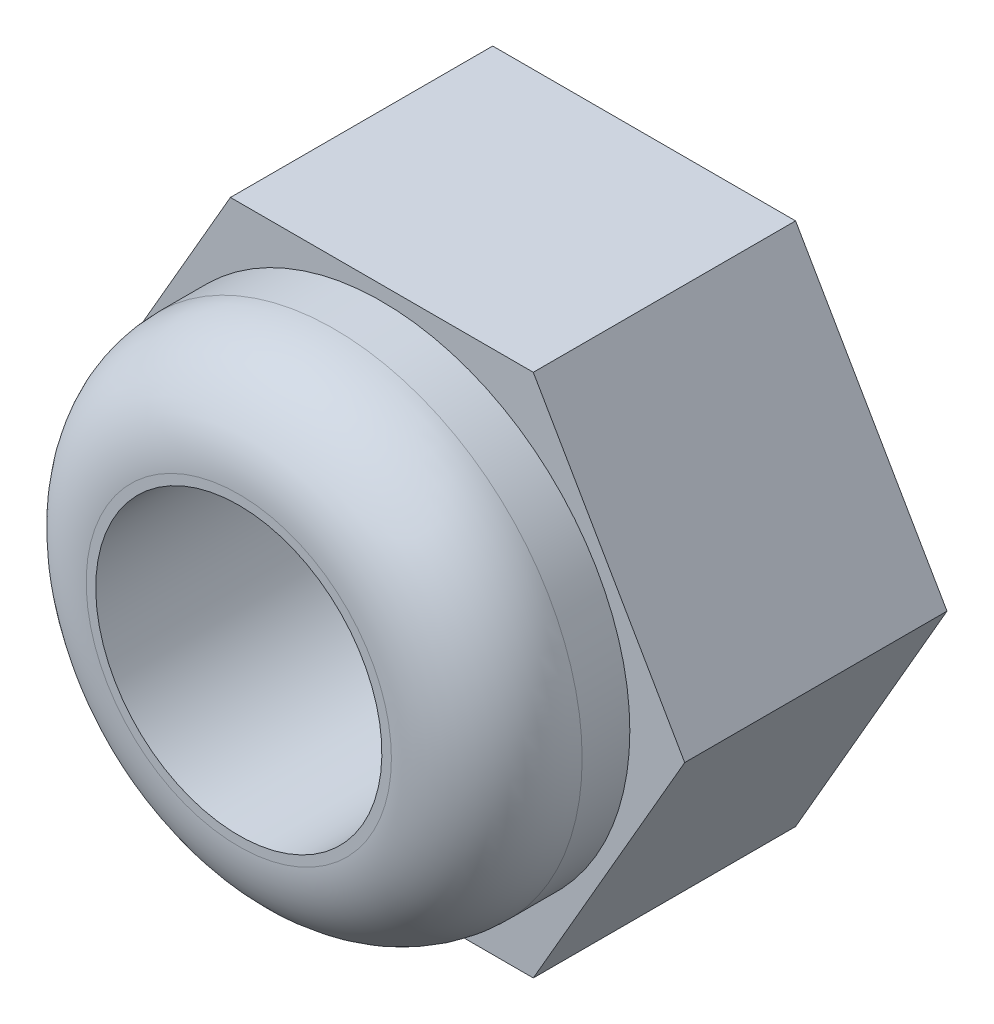
ISO-10303-21;
HEADER;
FILE_DESCRIPTION(('STEP AP214'),'2;1');
FILE_NAME('part.step','',(''),(''),'','','');
FILE_SCHEMA(('AUTOMOTIVE_DESIGN { 1 0 10303 214 1 1 1 1 }'));
ENDSEC;
DATA;
#1=APPLICATION_CONTEXT('core data for automotive mechanical design processes');
#2=APPLICATION_PROTOCOL_DEFINITION('international standard','automotive_design',2000,#1);
#3=PRODUCT_CONTEXT('',#1,'mechanical');
#4=PRODUCT('Part','Part','',(#3));
#5=PRODUCT_RELATED_PRODUCT_CATEGORY('part','',(#4));
#6=PRODUCT_DEFINITION_FORMATION('','',#4);
#7=PRODUCT_DEFINITION_CONTEXT('part definition',#1,'design');
#8=PRODUCT_DEFINITION('design','',#6,#7);
#9=PRODUCT_DEFINITION_SHAPE('','',#8);
#10=(LENGTH_UNIT() NAMED_UNIT(*) SI_UNIT(.MILLI.,.METRE.));
#11=(NAMED_UNIT(*) PLANE_ANGLE_UNIT() SI_UNIT($,.RADIAN.));
#12=(NAMED_UNIT(*) SI_UNIT($,.STERADIAN.) SOLID_ANGLE_UNIT());
#13=UNCERTAINTY_MEASURE_WITH_UNIT(LENGTH_MEASURE(1.E-05),#10,'distance_accuracy_value','');
#14=(GEOMETRIC_REPRESENTATION_CONTEXT(3) GLOBAL_UNCERTAINTY_ASSIGNED_CONTEXT((#13)) GLOBAL_UNIT_ASSIGNED_CONTEXT((#10,
#11,#12)) REPRESENTATION_CONTEXT('',''));
#15=CARTESIAN_POINT('',(0.,0.,0.));
#16=DIRECTION('',(0.,0.,1.));
#17=DIRECTION('',(1.,0.,0.));
#18=AXIS2_PLACEMENT_3D('',#15,#16,#17);
#19=CARTESIAN_POINT('',(-1.58771324027147,-2.75,0.));
#20=DIRECTION('',(0.,-1.,0.));
#21=DIRECTION('',(1.,0.,0.));
#22=AXIS2_PLACEMENT_3D('',#19,#20,#21);
#23=PLANE('',#22);
#24=DIRECTION('',(1.,0.,0.));
#25=VECTOR('',#24,1.);
#26=CARTESIAN_POINT('',(-1.58771324027147,-2.75,2.75));
#27=LINE('',#26,#25);
#28=CARTESIAN_POINT('',(-1.58771324027147,-2.75,2.75));
#29=VERTEX_POINT('',#28);
#30=CARTESIAN_POINT('',(1.58771324027147,-2.75,2.75));
#31=VERTEX_POINT('',#30);
#32=EDGE_CURVE('E134',#29,#31,#27,.T.);
#33=ORIENTED_EDGE('',*,*,#32,.F.);
#34=DIRECTION('',(0.,0.,1.));
#35=VECTOR('',#34,1.);
#36=CARTESIAN_POINT('',(-1.58771324027147,-2.75,0.));
#37=LINE('',#36,#35);
#38=CARTESIAN_POINT('',(-1.58771324027147,-2.75,0.));
#39=VERTEX_POINT('',#38);
#40=EDGE_CURVE('E57',#39,#29,#37,.T.);
#41=ORIENTED_EDGE('',*,*,#40,.F.);
#42=DIRECTION('',(1.,0.,0.));
#43=VECTOR('',#42,1.);
#44=CARTESIAN_POINT('',(-1.58771324027147,-2.75,0.));
#45=LINE('',#44,#43);
#46=CARTESIAN_POINT('',(1.58771324027147,-2.75,0.));
#47=VERTEX_POINT('',#46);
#48=EDGE_CURVE('E156',#39,#47,#45,.T.);
#49=ORIENTED_EDGE('',*,*,#48,.T.);
#50=DIRECTION('',(0.,0.,1.));
#51=VECTOR('',#50,1.);
#52=CARTESIAN_POINT('',(1.58771324027147,-2.75,0.));
#53=LINE('',#52,#51);
#54=EDGE_CURVE('E92',#47,#31,#53,.T.);
#55=ORIENTED_EDGE('',*,*,#54,.T.);
#56=EDGE_LOOP('',(#33,#41,#49,#55));
#57=FACE_BOUND('',#56,.T.);
#58=ADVANCED_FACE('F39',(#57),#23,.T.);
#59=CARTESIAN_POINT('',(-3.17542648054294,0.,0.));
#60=DIRECTION('',(-0.866025403784438,-0.500000000000001,0.));
#61=DIRECTION('',(0.500000000000001,-0.866025403784438,0.));
#62=AXIS2_PLACEMENT_3D('',#59,#60,#61);
#63=PLANE('',#62);
#64=DIRECTION('',(0.500000000000001,-0.866025403784438,0.));
#65=VECTOR('',#64,1.);
#66=CARTESIAN_POINT('',(-3.17542648054294,0.,2.75));
#67=LINE('',#66,#65);
#68=CARTESIAN_POINT('',(-3.17542648054294,0.,2.75));
#69=VERTEX_POINT('',#68);
#70=EDGE_CURVE('E152',#69,#29,#67,.T.);
#71=ORIENTED_EDGE('',*,*,#70,.F.);
#72=DIRECTION('',(0.,0.,1.));
#73=VECTOR('',#72,1.);
#74=CARTESIAN_POINT('',(-3.17542648054294,0.,0.));
#75=LINE('',#74,#73);
#76=CARTESIAN_POINT('',(-3.17542648054294,0.,0.));
#77=VERTEX_POINT('',#76);
#78=EDGE_CURVE('E80',#77,#69,#75,.T.);
#79=ORIENTED_EDGE('',*,*,#78,.F.);
#80=DIRECTION('',(0.500000000000001,-0.866025403784438,0.));
#81=VECTOR('',#80,1.);
#82=CARTESIAN_POINT('',(-3.17542648054294,0.,0.));
#83=LINE('',#82,#81);
#84=EDGE_CURVE('E119',#77,#39,#83,.T.);
#85=ORIENTED_EDGE('',*,*,#84,.T.);
#86=ORIENTED_EDGE('',*,*,#40,.T.);
#87=EDGE_LOOP('',(#71,#79,#85,#86));
#88=FACE_BOUND('',#87,.T.);
#89=ADVANCED_FACE('F188',(#88),#63,.T.);
#90=CARTESIAN_POINT('',(-1.58771324027147,2.75,0.));
#91=DIRECTION('',(-0.866025403784439,0.499999999999999,0.));
#92=DIRECTION('',(-0.499999999999999,-0.866025403784439,0.));
#93=AXIS2_PLACEMENT_3D('',#90,#91,#92);
#94=PLANE('',#93);
#95=DIRECTION('',(-0.499999999999999,-0.866025403784439,0.));
#96=VECTOR('',#95,1.);
#97=CARTESIAN_POINT('',(-1.58771324027147,2.75,2.75));
#98=LINE('',#97,#96);
#99=CARTESIAN_POINT('',(-1.58771324027147,2.75,2.75));
#100=VERTEX_POINT('',#99);
#101=EDGE_CURVE('E105',#100,#69,#98,.T.);
#102=ORIENTED_EDGE('',*,*,#101,.F.);
#103=DIRECTION('',(0.,0.,1.));
#104=VECTOR('',#103,1.);
#105=CARTESIAN_POINT('',(-1.58771324027147,2.75,0.));
#106=LINE('',#105,#104);
#107=CARTESIAN_POINT('',(-1.58771324027147,2.75,0.));
#108=VERTEX_POINT('',#107);
#109=EDGE_CURVE('E100',#108,#100,#106,.T.);
#110=ORIENTED_EDGE('',*,*,#109,.F.);
#111=DIRECTION('',(-0.499999999999999,-0.866025403784439,0.));
#112=VECTOR('',#111,1.);
#113=CARTESIAN_POINT('',(-1.58771324027147,2.75,0.));
#114=LINE('',#113,#112);
#115=EDGE_CURVE('E103',#108,#77,#114,.T.);
#116=ORIENTED_EDGE('',*,*,#115,.T.);
#117=ORIENTED_EDGE('',*,*,#78,.T.);
#118=EDGE_LOOP('',(#102,#110,#116,#117));
#119=FACE_BOUND('',#118,.T.);
#120=ADVANCED_FACE('F102',(#119),#94,.T.);
#121=CARTESIAN_POINT('',(1.58771324027147,2.75,0.));
#122=DIRECTION('',(0.,1.,0.));
#123=DIRECTION('',(-1.,0.,0.));
#124=AXIS2_PLACEMENT_3D('',#121,#122,#123);
#125=PLANE('',#124);
#126=DIRECTION('',(-1.,0.,0.));
#127=VECTOR('',#126,1.);
#128=CARTESIAN_POINT('',(1.58771324027147,2.75,2.75));
#129=LINE('',#128,#127);
#130=CARTESIAN_POINT('',(1.58771324027147,2.75,2.75));
#131=VERTEX_POINT('',#130);
#132=EDGE_CURVE('E147',#131,#100,#129,.T.);
#133=ORIENTED_EDGE('',*,*,#132,.F.);
#134=DIRECTION('',(0.,0.,1.));
#135=VECTOR('',#134,1.);
#136=CARTESIAN_POINT('',(1.58771324027147,2.75,0.));
#137=LINE('',#136,#135);
#138=CARTESIAN_POINT('',(1.58771324027147,2.75,0.));
#139=VERTEX_POINT('',#138);
#140=EDGE_CURVE('E111',#139,#131,#137,.T.);
#141=ORIENTED_EDGE('',*,*,#140,.F.);
#142=DIRECTION('',(-1.,0.,0.));
#143=VECTOR('',#142,1.);
#144=CARTESIAN_POINT('',(1.58771324027147,2.75,0.));
#145=LINE('',#144,#143);
#146=EDGE_CURVE('E117',#139,#108,#145,.T.);
#147=ORIENTED_EDGE('',*,*,#146,.T.);
#148=ORIENTED_EDGE('',*,*,#109,.T.);
#149=EDGE_LOOP('',(#133,#141,#147,#148));
#150=FACE_BOUND('',#149,.T.);
#151=ADVANCED_FACE('F122',(#150),#125,.T.);
#152=CARTESIAN_POINT('',(3.17542648054294,0.,0.));
#153=DIRECTION('',(0.866025403784438,0.500000000000001,0.));
#154=DIRECTION('',(-0.500000000000001,0.866025403784438,0.));
#155=AXIS2_PLACEMENT_3D('',#152,#153,#154);
#156=PLANE('',#155);
#157=DIRECTION('',(-0.500000000000001,0.866025403784438,0.));
#158=VECTOR('',#157,1.);
#159=CARTESIAN_POINT('',(3.17542648054294,0.,2.75));
#160=LINE('',#159,#158);
#161=CARTESIAN_POINT('',(3.17542648054294,0.,2.75));
#162=VERTEX_POINT('',#161);
#163=EDGE_CURVE('E143',#162,#131,#160,.T.);
#164=ORIENTED_EDGE('',*,*,#163,.F.);
#165=DIRECTION('',(0.,0.,1.));
#166=VECTOR('',#165,1.);
#167=CARTESIAN_POINT('',(3.17542648054294,0.,0.));
#168=LINE('',#167,#166);
#169=CARTESIAN_POINT('',(3.17542648054294,0.,0.));
#170=VERTEX_POINT('',#169);
#171=EDGE_CURVE('E164',#170,#162,#168,.T.);
#172=ORIENTED_EDGE('',*,*,#171,.F.);
#173=DIRECTION('',(-0.500000000000001,0.866025403784438,0.));
#174=VECTOR('',#173,1.);
#175=CARTESIAN_POINT('',(3.17542648054294,0.,0.));
#176=LINE('',#175,#174);
#177=EDGE_CURVE('E124',#170,#139,#176,.T.);
#178=ORIENTED_EDGE('',*,*,#177,.T.);
#179=ORIENTED_EDGE('',*,*,#140,.T.);
#180=EDGE_LOOP('',(#164,#172,#178,#179));
#181=FACE_BOUND('',#180,.T.);
#182=ADVANCED_FACE('F197',(#181),#156,.T.);
#183=CARTESIAN_POINT('',(1.58771324027147,-2.75,0.));
#184=DIRECTION('',(0.866025403784439,-0.5,0.));
#185=DIRECTION('',(0.5,0.866025403784439,0.));
#186=AXIS2_PLACEMENT_3D('',#183,#184,#185);
#187=PLANE('',#186);
#188=DIRECTION('',(0.5,0.866025403784439,0.));
#189=VECTOR('',#188,1.);
#190=CARTESIAN_POINT('',(1.58771324027147,-2.75,2.75));
#191=LINE('',#190,#189);
#192=EDGE_CURVE('E138',#31,#162,#191,.T.);
#193=ORIENTED_EDGE('',*,*,#192,.F.);
#194=ORIENTED_EDGE('',*,*,#54,.F.);
#195=DIRECTION('',(0.5,0.866025403784439,0.));
#196=VECTOR('',#195,1.);
#197=CARTESIAN_POINT('',(1.58771324027147,-2.75,0.));
#198=LINE('',#197,#196);
#199=EDGE_CURVE('E128',#47,#170,#198,.T.);
#200=ORIENTED_EDGE('',*,*,#199,.T.);
#201=ORIENTED_EDGE('',*,*,#171,.T.);
#202=EDGE_LOOP('',(#193,#194,#200,#201));
#203=FACE_BOUND('',#202,.T.);
#204=ADVANCED_FACE('F194',(#203),#187,.T.);
#205=CARTESIAN_POINT('',(0.,0.,0.));
#206=DIRECTION('',(0.,0.,1.));
#207=DIRECTION('',(1.,0.,0.));
#208=AXIS2_PLACEMENT_3D('',#205,#206,#207);
#209=PLANE('',#208);
#210=CARTESIAN_POINT('',(0.,0.,0.));
#211=DIRECTION('',(0.,0.,-1.));
#212=DIRECTION('',(0.,1.,0.));
#213=AXIS2_PLACEMENT_3D('',#210,#211,#212);
#214=CIRCLE('',#213,1.49999999999998);
#215=CARTESIAN_POINT('',(0.,1.49999999999999,0.));
#216=VERTEX_POINT('',#215);
#217=EDGE_CURVE('E307',#216,#216,#214,.T.);
#218=ORIENTED_EDGE('',*,*,#217,.F.);
#219=EDGE_LOOP('',(#218));
#220=FACE_BOUND('',#219,.T.);
#221=ORIENTED_EDGE('',*,*,#48,.F.);
#222=ORIENTED_EDGE('',*,*,#84,.F.);
#223=ORIENTED_EDGE('',*,*,#115,.F.);
#224=ORIENTED_EDGE('',*,*,#146,.F.);
#225=ORIENTED_EDGE('',*,*,#177,.F.);
#226=ORIENTED_EDGE('',*,*,#199,.F.);
#227=EDGE_LOOP('',(#221,#222,#223,#224,#225,#226));
#228=FACE_BOUND('',#227,.T.);
#229=ADVANCED_FACE('F115',(#220,#228),#209,.F.);
#230=CARTESIAN_POINT('',(0.,0.,2.75));
#231=DIRECTION('',(0.,0.,1.));
#232=DIRECTION('',(1.,0.,0.));
#233=AXIS2_PLACEMENT_3D('',#230,#231,#232);
#234=PLANE('',#233);
#235=CARTESIAN_POINT('',(0.,0.,2.75));
#236=DIRECTION('',(0.,0.,1.));
#237=DIRECTION('',(1.,0.,0.));
#238=AXIS2_PLACEMENT_3D('',#235,#236,#237);
#239=CIRCLE('',#238,2.6);
#240=CARTESIAN_POINT('',(2.6,0.,2.75));
#241=VERTEX_POINT('',#240);
#242=EDGE_CURVE('E159',#241,#241,#239,.T.);
#243=ORIENTED_EDGE('',*,*,#242,.F.);
#244=EDGE_LOOP('',(#243));
#245=FACE_BOUND('',#244,.T.);
#246=ORIENTED_EDGE('',*,*,#32,.T.);
#247=ORIENTED_EDGE('',*,*,#192,.T.);
#248=ORIENTED_EDGE('',*,*,#163,.T.);
#249=ORIENTED_EDGE('',*,*,#132,.T.);
#250=ORIENTED_EDGE('',*,*,#101,.T.);
#251=ORIENTED_EDGE('',*,*,#70,.T.);
#252=EDGE_LOOP('',(#246,#247,#248,#249,#250,#251));
#253=FACE_BOUND('',#252,.T.);
#254=ADVANCED_FACE('F205',(#245,#253),#234,.T.);
#255=CARTESIAN_POINT('',(0.,0.,2.75));
#256=DIRECTION('',(0.,0.,1.));
#257=DIRECTION('',(1.,0.,0.));
#258=AXIS2_PLACEMENT_3D('',#255,#256,#257);
#259=CYLINDRICAL_SURFACE('',#258,2.6);
#260=CARTESIAN_POINT('',(0.,0.,3.25));
#261=DIRECTION('',(0.,0.,1.));
#262=DIRECTION('',(1.,0.,0.));
#263=AXIS2_PLACEMENT_3D('',#260,#261,#262);
#264=CIRCLE('',#263,2.6);
#265=CARTESIAN_POINT('',(2.6,0.,3.25));
#266=VERTEX_POINT('',#265);
#267=EDGE_CURVE('E11',#266,#266,#264,.F.);
#268=ORIENTED_EDGE('',*,*,#267,.T.);
#269=EDGE_LOOP('',(#268));
#270=FACE_BOUND('',#269,.T.);
#271=ORIENTED_EDGE('',*,*,#242,.T.);
#272=EDGE_LOOP('',(#271));
#273=FACE_BOUND('',#272,.T.);
#274=ADVANCED_FACE('F208',(#270,#273),#259,.T.);
#275=CARTESIAN_POINT('',(0.,0.,4.25));
#276=DIRECTION('',(0.,0.,1.));
#277=DIRECTION('',(1.,0.,0.));
#278=AXIS2_PLACEMENT_3D('',#275,#276,#277);
#279=PLANE('',#278);
#280=CARTESIAN_POINT('',(0.,0.,4.25));
#281=DIRECTION('',(0.,0.,1.));
#282=DIRECTION('',(1.,0.,0.));
#283=AXIS2_PLACEMENT_3D('',#280,#281,#282);
#284=CIRCLE('',#283,1.6);
#285=CARTESIAN_POINT('',(1.6,0.,4.25));
#286=VERTEX_POINT('',#285);
#287=EDGE_CURVE('E49',#286,#286,#284,.T.);
#288=ORIENTED_EDGE('',*,*,#287,.T.);
#289=EDGE_LOOP('',(#288));
#290=FACE_BOUND('',#289,.T.);
#291=CARTESIAN_POINT('',(0.,0.,4.25));
#292=DIRECTION('',(0.,0.,-1.));
#293=DIRECTION('',(0.,1.,0.));
#294=AXIS2_PLACEMENT_3D('',#291,#292,#293);
#295=CIRCLE('',#294,1.49999999999998);
#296=CARTESIAN_POINT('',(0.,1.49999999999999,4.25));
#297=VERTEX_POINT('',#296);
#298=EDGE_CURVE('E139',#297,#297,#295,.T.);
#299=ORIENTED_EDGE('',*,*,#298,.T.);
#300=EDGE_LOOP('',(#299));
#301=FACE_BOUND('',#300,.T.);
#302=ADVANCED_FACE('F175',(#290,#301),#279,.T.);
#303=CARTESIAN_POINT('',(0.,0.,0.));
#304=DIRECTION('',(0.,0.,-1.));
#305=DIRECTION('',(0.,1.,0.));
#306=AXIS2_PLACEMENT_3D('',#303,#304,#305);
#307=CYLINDRICAL_SURFACE('',#306,1.49999999999998);
#308=ORIENTED_EDGE('',*,*,#298,.F.);
#309=EDGE_LOOP('',(#308));
#310=FACE_BOUND('',#309,.T.);
#311=ORIENTED_EDGE('',*,*,#217,.T.);
#312=EDGE_LOOP('',(#311));
#313=FACE_BOUND('',#312,.T.);
#314=ADVANCED_FACE('F179',(#310,#313),#307,.F.);
#315=CARTESIAN_POINT('',(0.,0.,3.25));
#316=DIRECTION('',(0.,0.,1.));
#317=DIRECTION('',(1.,0.,0.));
#318=AXIS2_PLACEMENT_3D('',#315,#316,#317);
#319=TOROIDAL_SURFACE('',#318,1.6,1.);
#320=ORIENTED_EDGE('',*,*,#267,.F.);
#321=EDGE_LOOP('',(#320));
#322=FACE_BOUND('',#321,.T.);
#323=ORIENTED_EDGE('',*,*,#287,.F.);
#324=EDGE_LOOP('',(#323));
#325=FACE_BOUND('',#324,.T.);
#326=ADVANCED_FACE('F41',(#322,#325),#319,.T.);
#327=CLOSED_SHELL('',(#58,#89,#120,#151,#182,#204,#229,#254,#274,#302,#314,#326));
#328=MANIFOLD_SOLID_BREP('B2',#327);
#329=ADVANCED_BREP_SHAPE_REPRESENTATION('',(#18,#328),#14);
#330=SHAPE_DEFINITION_REPRESENTATION(#9,#329);
ENDSEC;
END-ISO-10303-21;
